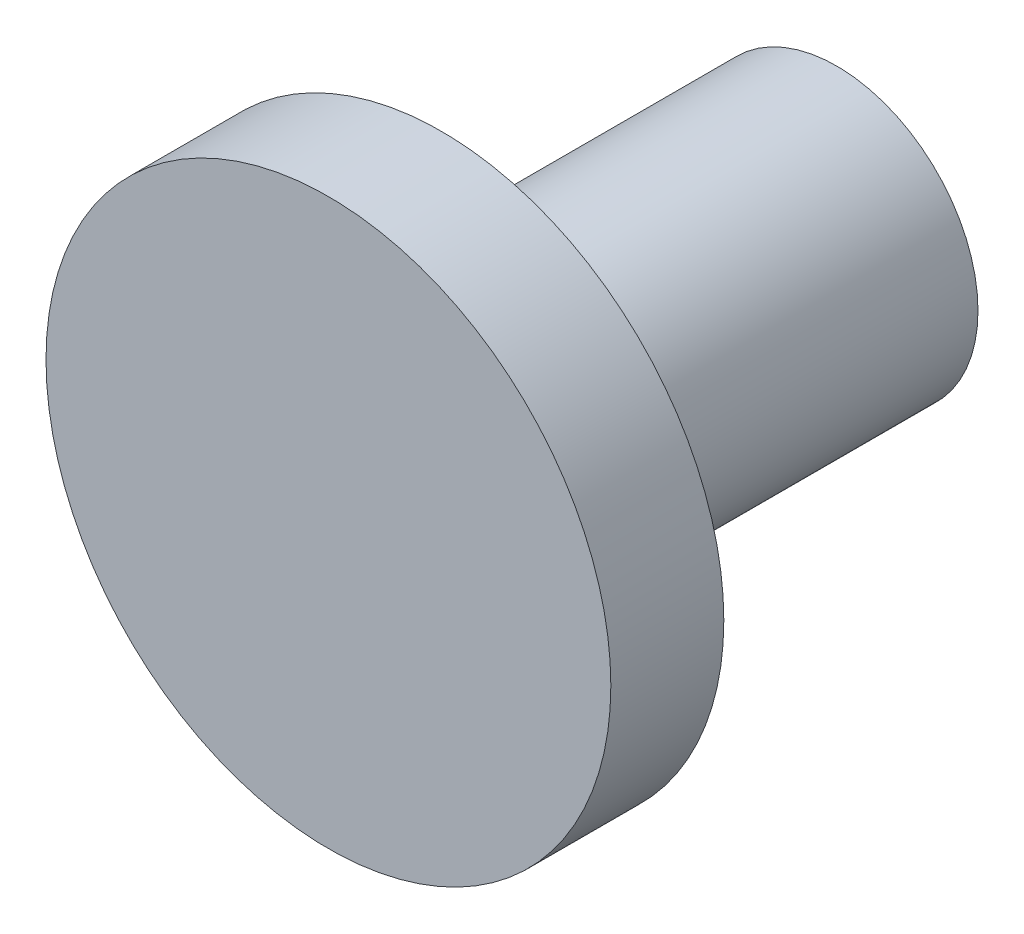
ISO-10303-21;
HEADER;
FILE_DESCRIPTION(('STEP AP214'),'2;1');
FILE_NAME('part.step','',(''),(''),'','','');
FILE_SCHEMA(('AUTOMOTIVE_DESIGN { 1 0 10303 214 1 1 1 1 }'));
ENDSEC;
DATA;
#1=APPLICATION_CONTEXT('core data for automotive mechanical design processes');
#2=APPLICATION_PROTOCOL_DEFINITION('international standard','automotive_design',2000,#1);
#3=PRODUCT_CONTEXT('',#1,'mechanical');
#4=PRODUCT('Part','Part','',(#3));
#5=PRODUCT_RELATED_PRODUCT_CATEGORY('part','',(#4));
#6=PRODUCT_DEFINITION_FORMATION('','',#4);
#7=PRODUCT_DEFINITION_CONTEXT('part definition',#1,'design');
#8=PRODUCT_DEFINITION('design','',#6,#7);
#9=PRODUCT_DEFINITION_SHAPE('','',#8);
#10=(LENGTH_UNIT() NAMED_UNIT(*) SI_UNIT(.MILLI.,.METRE.));
#11=(NAMED_UNIT(*) PLANE_ANGLE_UNIT() SI_UNIT($,.RADIAN.));
#12=(NAMED_UNIT(*) SI_UNIT($,.STERADIAN.) SOLID_ANGLE_UNIT());
#13=UNCERTAINTY_MEASURE_WITH_UNIT(LENGTH_MEASURE(1.E-05),#10,'distance_accuracy_value','');
#14=(GEOMETRIC_REPRESENTATION_CONTEXT(3) GLOBAL_UNCERTAINTY_ASSIGNED_CONTEXT((#13)) GLOBAL_UNIT_ASSIGNED_CONTEXT((#10,
#11,#12)) REPRESENTATION_CONTEXT('',''));
#15=CARTESIAN_POINT('',(0.,0.,0.));
#16=DIRECTION('',(0.,0.,1.));
#17=DIRECTION('',(1.,0.,0.));
#18=AXIS2_PLACEMENT_3D('',#15,#16,#17);
#19=CARTESIAN_POINT('',(0.,0.,18.));
#20=DIRECTION('',(0.,0.,-1.));
#21=DIRECTION('',(-1.,0.,0.));
#22=AXIS2_PLACEMENT_3D('',#19,#20,#21);
#23=CYLINDRICAL_SURFACE('',#22,5.);
#24=CARTESIAN_POINT('',(0.,0.,0.));
#25=DIRECTION('',(0.,0.,1.));
#26=DIRECTION('',(1.,0.,0.));
#27=AXIS2_PLACEMENT_3D('',#24,#25,#26);
#28=CIRCLE('',#27,5.);
#29=CARTESIAN_POINT('',(5.,0.,0.));
#30=VERTEX_POINT('',#29);
#31=EDGE_CURVE('E44',#30,#30,#28,.T.);
#32=ORIENTED_EDGE('',*,*,#31,.T.);
#33=EDGE_LOOP('',(#32));
#34=FACE_BOUND('',#33,.T.);
#35=CARTESIAN_POINT('',(0.,0.,14.));
#36=DIRECTION('',(0.,0.,1.));
#37=DIRECTION('',(1.,0.,0.));
#38=AXIS2_PLACEMENT_3D('',#35,#36,#37);
#39=CIRCLE('',#38,5.);
#40=CARTESIAN_POINT('',(5.,0.,14.));
#41=VERTEX_POINT('',#40);
#42=EDGE_CURVE('E10',#41,#41,#39,.T.);
#43=ORIENTED_EDGE('',*,*,#42,.F.);
#44=EDGE_LOOP('',(#43));
#45=FACE_BOUND('',#44,.T.);
#46=ADVANCED_FACE('F37',(#34,#45),#23,.T.);
#47=CARTESIAN_POINT('',(0.,0.,0.));
#48=DIRECTION('',(0.,0.,1.));
#49=DIRECTION('',(1.,0.,0.));
#50=AXIS2_PLACEMENT_3D('',#47,#48,#49);
#51=PLANE('',#50);
#52=CARTESIAN_POINT('',(0.,0.,0.));
#53=DIRECTION('',(0.,0.,-1.));
#54=DIRECTION('',(-1.,0.,0.));
#55=AXIS2_PLACEMENT_3D('',#52,#53,#54);
#56=CIRCLE('',#55,1.6);
#57=CARTESIAN_POINT('',(-1.6,0.,0.));
#58=VERTEX_POINT('',#57);
#59=EDGE_CURVE('E61',#58,#58,#56,.T.);
#60=ORIENTED_EDGE('',*,*,#59,.F.);
#61=EDGE_LOOP('',(#60));
#62=FACE_BOUND('',#61,.T.);
#63=ORIENTED_EDGE('',*,*,#31,.F.);
#64=EDGE_LOOP('',(#63));
#65=FACE_BOUND('',#64,.T.);
#66=ADVANCED_FACE('F78',(#62,#65),#51,.F.);
#67=CARTESIAN_POINT('',(0.,0.,14.));
#68=DIRECTION('',(0.,0.,1.));
#69=DIRECTION('',(1.,0.,0.));
#70=AXIS2_PLACEMENT_3D('',#67,#68,#69);
#71=CYLINDRICAL_SURFACE('',#70,10.);
#72=CARTESIAN_POINT('',(0.,0.,14.));
#73=DIRECTION('',(0.,0.,1.));
#74=DIRECTION('',(1.,0.,0.));
#75=AXIS2_PLACEMENT_3D('',#72,#73,#74);
#76=CIRCLE('',#75,10.);
#77=CARTESIAN_POINT('',(10.,0.,14.));
#78=VERTEX_POINT('',#77);
#79=EDGE_CURVE('E49',#78,#78,#76,.T.);
#80=ORIENTED_EDGE('',*,*,#79,.T.);
#81=EDGE_LOOP('',(#80));
#82=FACE_BOUND('',#81,.T.);
#83=CARTESIAN_POINT('',(0.,0.,18.));
#84=DIRECTION('',(0.,0.,1.));
#85=DIRECTION('',(1.,0.,0.));
#86=AXIS2_PLACEMENT_3D('',#83,#84,#85);
#87=CIRCLE('',#86,10.);
#88=CARTESIAN_POINT('',(10.,0.,18.));
#89=VERTEX_POINT('',#88);
#90=EDGE_CURVE('E54',#89,#89,#87,.T.);
#91=ORIENTED_EDGE('',*,*,#90,.F.);
#92=EDGE_LOOP('',(#91));
#93=FACE_BOUND('',#92,.T.);
#94=ADVANCED_FACE('F81',(#82,#93),#71,.T.);
#95=CARTESIAN_POINT('',(0.,0.,14.));
#96=DIRECTION('',(0.,0.,1.));
#97=DIRECTION('',(1.,0.,0.));
#98=AXIS2_PLACEMENT_3D('',#95,#96,#97);
#99=PLANE('',#98);
#100=ORIENTED_EDGE('',*,*,#42,.T.);
#101=EDGE_LOOP('',(#100));
#102=FACE_BOUND('',#101,.T.);
#103=ORIENTED_EDGE('',*,*,#79,.F.);
#104=EDGE_LOOP('',(#103));
#105=FACE_BOUND('',#104,.T.);
#106=ADVANCED_FACE('F86',(#102,#105),#99,.F.);
#107=CARTESIAN_POINT('',(0.,0.,18.));
#108=DIRECTION('',(0.,0.,1.));
#109=DIRECTION('',(1.,0.,0.));
#110=AXIS2_PLACEMENT_3D('',#107,#108,#109);
#111=PLANE('',#110);
#112=ORIENTED_EDGE('',*,*,#90,.T.);
#113=EDGE_LOOP('',(#112));
#114=FACE_BOUND('',#113,.T.);
#115=ADVANCED_FACE('F74',(#114),#111,.T.);
#116=CARTESIAN_POINT('',(0.,0.,12.));
#117=DIRECTION('',(0.,0.,-1.));
#118=DIRECTION('',(-1.,0.,0.));
#119=AXIS2_PLACEMENT_3D('',#116,#117,#118);
#120=CYLINDRICAL_SURFACE('',#119,1.6);
#121=CARTESIAN_POINT('',(0.,0.,12.));
#122=DIRECTION('',(0.,0.,-1.));
#123=DIRECTION('',(-1.,0.,0.));
#124=AXIS2_PLACEMENT_3D('',#121,#122,#123);
#125=CIRCLE('',#124,1.6);
#126=CARTESIAN_POINT('',(-1.6,0.,12.));
#127=VERTEX_POINT('',#126);
#128=EDGE_CURVE('E59',#127,#127,#125,.T.);
#129=ORIENTED_EDGE('',*,*,#128,.F.);
#130=EDGE_LOOP('',(#129));
#131=FACE_BOUND('',#130,.T.);
#132=ORIENTED_EDGE('',*,*,#59,.T.);
#133=EDGE_LOOP('',(#132));
#134=FACE_BOUND('',#133,.T.);
#135=ADVANCED_FACE('F71',(#131,#134),#120,.F.);
#136=CARTESIAN_POINT('',(0.,0.,12.));
#137=DIRECTION('',(0.,0.,-1.));
#138=DIRECTION('',(-1.,0.,0.));
#139=AXIS2_PLACEMENT_3D('',#136,#137,#138);
#140=PLANE('',#139);
#141=ORIENTED_EDGE('',*,*,#128,.T.);
#142=EDGE_LOOP('',(#141));
#143=FACE_BOUND('',#142,.T.);
#144=ADVANCED_FACE('F69',(#143),#140,.T.);
#145=CLOSED_SHELL('',(#46,#66,#94,#106,#115,#135,#144));
#146=MANIFOLD_SOLID_BREP('B2',#145);
#147=ADVANCED_BREP_SHAPE_REPRESENTATION('',(#18,#146),#14);
#148=SHAPE_DEFINITION_REPRESENTATION(#9,#147);
ENDSEC;
END-ISO-10303-21;
